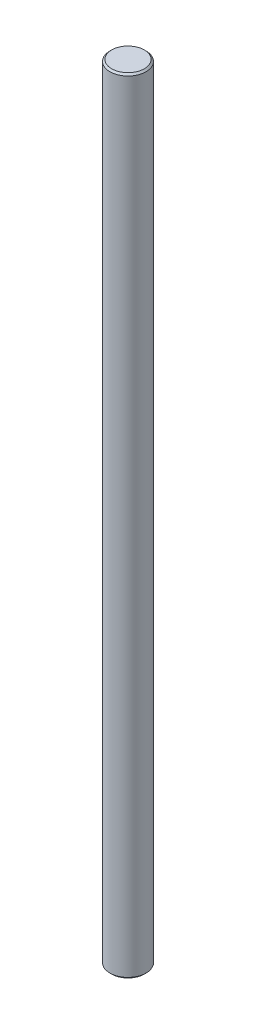
ISO-10303-21;
HEADER;
FILE_DESCRIPTION(('STEP AP214'),'2;1');
FILE_NAME('part.step','',(''),(''),'','','');
FILE_SCHEMA(('AUTOMOTIVE_DESIGN { 1 0 10303 214 1 1 1 1 }'));
ENDSEC;
DATA;
#1=APPLICATION_CONTEXT('core data for automotive mechanical design processes');
#2=APPLICATION_PROTOCOL_DEFINITION('international standard','automotive_design',2000,#1);
#3=PRODUCT_CONTEXT('',#1,'mechanical');
#4=PRODUCT('Part','Part','',(#3));
#5=PRODUCT_RELATED_PRODUCT_CATEGORY('part','',(#4));
#6=PRODUCT_DEFINITION_FORMATION('','',#4);
#7=PRODUCT_DEFINITION_CONTEXT('part definition',#1,'design');
#8=PRODUCT_DEFINITION('design','',#6,#7);
#9=PRODUCT_DEFINITION_SHAPE('','',#8);
#10=(LENGTH_UNIT() NAMED_UNIT(*) SI_UNIT(.MILLI.,.METRE.));
#11=(NAMED_UNIT(*) PLANE_ANGLE_UNIT() SI_UNIT($,.RADIAN.));
#12=(NAMED_UNIT(*) SI_UNIT($,.STERADIAN.) SOLID_ANGLE_UNIT());
#13=UNCERTAINTY_MEASURE_WITH_UNIT(LENGTH_MEASURE(1.E-05),#10,'distance_accuracy_value','');
#14=(GEOMETRIC_REPRESENTATION_CONTEXT(3) GLOBAL_UNCERTAINTY_ASSIGNED_CONTEXT((#13)) GLOBAL_UNIT_ASSIGNED_CONTEXT((#10,
#11,#12)) REPRESENTATION_CONTEXT('',''));
#15=CARTESIAN_POINT('',(0.,0.,0.));
#16=DIRECTION('',(0.,0.,1.));
#17=DIRECTION('',(1.,0.,0.));
#18=AXIS2_PLACEMENT_3D('',#15,#16,#17);
#19=CARTESIAN_POINT('',(0.,138.,0.));
#20=DIRECTION('',(0.,-1.,0.));
#21=DIRECTION('',(0.,0.,-1.));
#22=AXIS2_PLACEMENT_3D('',#19,#20,#21);
#23=CYLINDRICAL_SURFACE('',#22,3.175);
#24=CARTESIAN_POINT('',(0.,0.299999999999995,0.));
#25=DIRECTION('',(0.,1.,0.));
#26=DIRECTION('',(0.,0.,1.));
#27=AXIS2_PLACEMENT_3D('',#24,#25,#26);
#28=CIRCLE('',#27,3.175);
#29=CARTESIAN_POINT('',(0.,0.299999999999995,3.175));
#30=VERTEX_POINT('',#29);
#31=EDGE_CURVE('E55',#30,#30,#28,.T.);
#32=ORIENTED_EDGE('',*,*,#31,.T.);
#33=EDGE_LOOP('',(#32));
#34=FACE_BOUND('',#33,.T.);
#35=CARTESIAN_POINT('',(0.,137.7,0.));
#36=DIRECTION('',(0.,1.,0.));
#37=DIRECTION('',(0.,0.,1.));
#38=AXIS2_PLACEMENT_3D('',#35,#36,#37);
#39=CIRCLE('',#38,3.175);
#40=CARTESIAN_POINT('',(0.,137.7,3.175));
#41=VERTEX_POINT('',#40);
#42=EDGE_CURVE('E59',#41,#41,#39,.F.);
#43=ORIENTED_EDGE('',*,*,#42,.T.);
#44=EDGE_LOOP('',(#43));
#45=FACE_BOUND('',#44,.T.);
#46=ADVANCED_FACE('F43',(#34,#45),#23,.T.);
#47=CARTESIAN_POINT('',(0.,138.,0.));
#48=DIRECTION('',(0.,1.,0.));
#49=DIRECTION('',(0.,0.,1.));
#50=AXIS2_PLACEMENT_3D('',#47,#48,#49);
#51=PLANE('',#50);
#52=CARTESIAN_POINT('',(0.,138.,0.));
#53=DIRECTION('',(0.,1.,0.));
#54=DIRECTION('',(0.,0.,1.));
#55=AXIS2_PLACEMENT_3D('',#52,#53,#54);
#56=CIRCLE('',#55,2.875);
#57=CARTESIAN_POINT('',(0.,138.,2.875));
#58=VERTEX_POINT('',#57);
#59=EDGE_CURVE('E10',#58,#58,#56,.T.);
#60=ORIENTED_EDGE('',*,*,#59,.T.);
#61=EDGE_LOOP('',(#60));
#62=FACE_BOUND('',#61,.T.);
#63=ADVANCED_FACE('F75',(#62),#51,.T.);
#64=CARTESIAN_POINT('',(0.,0.,0.));
#65=DIRECTION('',(0.,1.,0.));
#66=DIRECTION('',(0.,0.,1.));
#67=AXIS2_PLACEMENT_3D('',#64,#65,#66);
#68=PLANE('',#67);
#69=CARTESIAN_POINT('',(0.,0.,0.));
#70=DIRECTION('',(0.,1.,0.));
#71=DIRECTION('',(0.,0.,1.));
#72=AXIS2_PLACEMENT_3D('',#69,#70,#71);
#73=CIRCLE('',#72,2.87499999999999);
#74=CARTESIAN_POINT('',(0.,0.,2.87499999999999));
#75=VERTEX_POINT('',#74);
#76=EDGE_CURVE('E51',#75,#75,#73,.F.);
#77=ORIENTED_EDGE('',*,*,#76,.T.);
#78=EDGE_LOOP('',(#77));
#79=FACE_BOUND('',#78,.T.);
#80=ADVANCED_FACE('F72',(#79),#68,.F.);
#81=CARTESIAN_POINT('',(0.,0.299999999999995,0.));
#82=DIRECTION('',(0.,1.,0.));
#83=DIRECTION('',(0.,0.,1.));
#84=AXIS2_PLACEMENT_3D('',#81,#82,#83);
#85=CONICAL_SURFACE('',#84,3.175,0.785398163397475);
#86=ORIENTED_EDGE('',*,*,#76,.F.);
#87=EDGE_LOOP('',(#86));
#88=FACE_BOUND('',#87,.T.);
#89=ORIENTED_EDGE('',*,*,#31,.F.);
#90=EDGE_LOOP('',(#89));
#91=FACE_BOUND('',#90,.T.);
#92=ADVANCED_FACE('F68',(#88,#91),#85,.T.);
#93=CARTESIAN_POINT('',(0.,138.,0.));
#94=DIRECTION('',(0.,-1.,0.));
#95=DIRECTION('',(0.,0.,-1.));
#96=AXIS2_PLACEMENT_3D('',#93,#94,#95);
#97=CONICAL_SURFACE('',#96,2.875,0.785398163397453);
#98=ORIENTED_EDGE('',*,*,#42,.F.);
#99=EDGE_LOOP('',(#98));
#100=FACE_BOUND('',#99,.T.);
#101=ORIENTED_EDGE('',*,*,#59,.F.);
#102=EDGE_LOOP('',(#101));
#103=FACE_BOUND('',#102,.T.);
#104=ADVANCED_FACE('F46',(#100,#103),#97,.T.);
#105=CLOSED_SHELL('',(#46,#63,#80,#92,#104));
#106=MANIFOLD_SOLID_BREP('B2',#105);
#107=ADVANCED_BREP_SHAPE_REPRESENTATION('',(#18,#106),#14);
#108=SHAPE_DEFINITION_REPRESENTATION(#9,#107);
ENDSEC;
END-ISO-10303-21;
